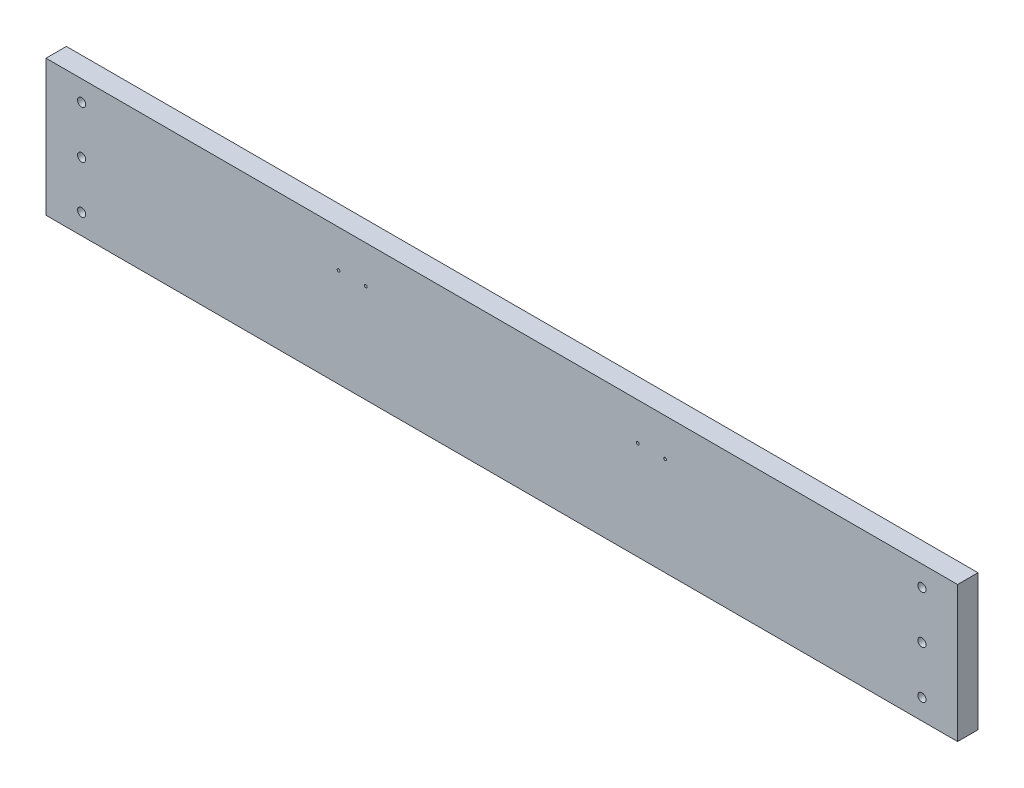
ISO-10303-21;
HEADER;
FILE_DESCRIPTION(('STEP AP214'),'2;1');
FILE_NAME('part.step','',(''),(''),'','','');
FILE_SCHEMA(('AUTOMOTIVE_DESIGN { 1 0 10303 214 1 1 1 1 }'));
ENDSEC;
DATA;
#1=APPLICATION_CONTEXT('core data for automotive mechanical design processes');
#2=APPLICATION_PROTOCOL_DEFINITION('international standard','automotive_design',2000,#1);
#3=PRODUCT_CONTEXT('',#1,'mechanical');
#4=PRODUCT('Part','Part','',(#3));
#5=PRODUCT_RELATED_PRODUCT_CATEGORY('part','',(#4));
#6=PRODUCT_DEFINITION_FORMATION('','',#4);
#7=PRODUCT_DEFINITION_CONTEXT('part definition',#1,'design');
#8=PRODUCT_DEFINITION('design','',#6,#7);
#9=PRODUCT_DEFINITION_SHAPE('','',#8);
#10=(LENGTH_UNIT() NAMED_UNIT(*) SI_UNIT(.MILLI.,.METRE.));
#11=(NAMED_UNIT(*) PLANE_ANGLE_UNIT() SI_UNIT($,.RADIAN.));
#12=(NAMED_UNIT(*) SI_UNIT($,.STERADIAN.) SOLID_ANGLE_UNIT());
#13=UNCERTAINTY_MEASURE_WITH_UNIT(LENGTH_MEASURE(1.E-05),#10,'distance_accuracy_value','');
#14=(GEOMETRIC_REPRESENTATION_CONTEXT(3) GLOBAL_UNCERTAINTY_ASSIGNED_CONTEXT((#13)) GLOBAL_UNIT_ASSIGNED_CONTEXT((#10,
#11,#12)) REPRESENTATION_CONTEXT('',''));
#15=CARTESIAN_POINT('',(0.,0.,0.));
#16=DIRECTION('',(0.,0.,1.));
#17=DIRECTION('',(1.,0.,0.));
#18=AXIS2_PLACEMENT_3D('',#15,#16,#17);
#19=CARTESIAN_POINT('',(0.,127.,0.));
#20=DIRECTION('',(0.,0.,-1.));
#21=DIRECTION('',(-1.,0.,0.));
#22=AXIS2_PLACEMENT_3D('',#19,#20,#21);
#23=PLANE('',#22);
#24=CARTESIAN_POINT('',(279.4,91.9479999999999,0.));
#25=DIRECTION('',(0.,0.,-1.));
#26=DIRECTION('',(-1.,0.,0.));
#27=AXIS2_PLACEMENT_3D('',#24,#25,#26);
#28=CIRCLE('',#27,1.27000000000004);
#29=CARTESIAN_POINT('',(278.13,91.9479999999999,0.));
#30=VERTEX_POINT('',#29);
#31=EDGE_CURVE('E377',#30,#30,#28,.F.);
#32=ORIENTED_EDGE('',*,*,#31,.T.);
#33=EDGE_LOOP('',(#32));
#34=FACE_BOUND('',#33,.T.);
#35=CARTESIAN_POINT('',(254.,91.9479999999999,0.));
#36=DIRECTION('',(0.,0.,-1.));
#37=DIRECTION('',(-1.,0.,0.));
#38=AXIS2_PLACEMENT_3D('',#35,#36,#37);
#39=CIRCLE('',#38,1.27000000000004);
#40=CARTESIAN_POINT('',(252.73,91.9479999999999,0.));
#41=VERTEX_POINT('',#40);
#42=EDGE_CURVE('E381',#41,#41,#39,.F.);
#43=ORIENTED_EDGE('',*,*,#42,.T.);
#44=EDGE_LOOP('',(#43));
#45=FACE_BOUND('',#44,.T.);
#46=CARTESIAN_POINT('',(14.224,63.5,0.));
#47=DIRECTION('',(0.,0.,-1.));
#48=DIRECTION('',(-1.,0.,0.));
#49=AXIS2_PLACEMENT_3D('',#46,#47,#48);
#50=CIRCLE('',#49,3.80999999999999);
#51=CARTESIAN_POINT('',(10.414,63.5,0.));
#52=VERTEX_POINT('',#51);
#53=EDGE_CURVE('E248',#52,#52,#50,.F.);
#54=ORIENTED_EDGE('',*,*,#53,.T.);
#55=EDGE_LOOP('',(#54));
#56=FACE_BOUND('',#55,.T.);
#57=CARTESIAN_POINT('',(14.224,19.05,0.));
#58=DIRECTION('',(0.,0.,-1.));
#59=DIRECTION('',(-1.,0.,0.));
#60=AXIS2_PLACEMENT_3D('',#57,#58,#59);
#61=CIRCLE('',#60,3.80999999999999);
#62=CARTESIAN_POINT('',(10.414,19.05,0.));
#63=VERTEX_POINT('',#62);
#64=EDGE_CURVE('E255',#63,#63,#61,.F.);
#65=ORIENTED_EDGE('',*,*,#64,.T.);
#66=EDGE_LOOP('',(#65));
#67=FACE_BOUND('',#66,.T.);
#68=CARTESIAN_POINT('',(14.224,107.95,0.));
#69=DIRECTION('',(0.,0.,-1.));
#70=DIRECTION('',(-1.,0.,0.));
#71=AXIS2_PLACEMENT_3D('',#68,#69,#70);
#72=CIRCLE('',#71,3.80999999999999);
#73=CARTESIAN_POINT('',(10.414,107.95,0.));
#74=VERTEX_POINT('',#73);
#75=EDGE_CURVE('E251',#74,#74,#72,.F.);
#76=ORIENTED_EDGE('',*,*,#75,.T.);
#77=EDGE_LOOP('',(#76));
#78=FACE_BOUND('',#77,.T.);
#79=CARTESIAN_POINT('',(798.576,63.5,0.));
#80=DIRECTION('',(0.,0.,-1.));
#81=DIRECTION('',(-1.,0.,0.));
#82=AXIS2_PLACEMENT_3D('',#79,#80,#81);
#83=CIRCLE('',#82,3.80999999999999);
#84=CARTESIAN_POINT('',(794.766,63.5,0.));
#85=VERTEX_POINT('',#84);
#86=EDGE_CURVE('E242',#85,#85,#83,.T.);
#87=ORIENTED_EDGE('',*,*,#86,.F.);
#88=EDGE_LOOP('',(#87));
#89=FACE_BOUND('',#88,.T.);
#90=CARTESIAN_POINT('',(798.576,107.95,0.));
#91=DIRECTION('',(0.,0.,-1.));
#92=DIRECTION('',(-1.,0.,0.));
#93=AXIS2_PLACEMENT_3D('',#90,#91,#92);
#94=CIRCLE('',#93,3.80999999999999);
#95=CARTESIAN_POINT('',(794.766,107.95,0.));
#96=VERTEX_POINT('',#95);
#97=EDGE_CURVE('E267',#96,#96,#94,.T.);
#98=ORIENTED_EDGE('',*,*,#97,.F.);
#99=EDGE_LOOP('',(#98));
#100=FACE_BOUND('',#99,.T.);
#101=CARTESIAN_POINT('',(798.576,19.05,0.));
#102=DIRECTION('',(0.,0.,-1.));
#103=DIRECTION('',(-1.,0.,0.));
#104=AXIS2_PLACEMENT_3D('',#101,#102,#103);
#105=CIRCLE('',#104,3.80999999999999);
#106=CARTESIAN_POINT('',(794.766,19.05,0.));
#107=VERTEX_POINT('',#106);
#108=EDGE_CURVE('E261',#107,#107,#105,.T.);
#109=ORIENTED_EDGE('',*,*,#108,.F.);
#110=EDGE_LOOP('',(#109));
#111=FACE_BOUND('',#110,.T.);
#112=CARTESIAN_POINT('',(682.498,28.702,0.));
#113=DIRECTION('',(0.,0.,-1.));
#114=DIRECTION('',(-1.,0.,0.));
#115=AXIS2_PLACEMENT_3D('',#112,#113,#114);
#116=CIRCLE('',#115,19.05);
#117=CARTESIAN_POINT('',(663.448,28.702,0.));
#118=VERTEX_POINT('',#117);
#119=CARTESIAN_POINT('',(701.548,28.702,0.));
#120=VERTEX_POINT('',#119);
#121=EDGE_CURVE('E180',#118,#120,#116,.T.);
#122=ORIENTED_EDGE('',*,*,#121,.F.);
#123=DIRECTION('',(0.,-1.,0.));
#124=VECTOR('',#123,1.);
#125=CARTESIAN_POINT('',(663.448,0.,0.));
#126=LINE('',#125,#124);
#127=CARTESIAN_POINT('',(663.448,0.,0.));
#128=VERTEX_POINT('',#127);
#129=EDGE_CURVE('E159',#118,#128,#126,.T.);
#130=ORIENTED_EDGE('',*,*,#129,.T.);
#131=DIRECTION('',(1.,0.,0.));
#132=VECTOR('',#131,1.);
#133=CARTESIAN_POINT('',(0.,0.,0.));
#134=LINE('',#133,#132);
#135=CARTESIAN_POINT('',(425.45,0.,0.));
#136=VERTEX_POINT('',#135);
#137=EDGE_CURVE('E349',#136,#128,#134,.T.);
#138=ORIENTED_EDGE('',*,*,#137,.F.);
#139=DIRECTION('',(0.,-1.,0.));
#140=VECTOR('',#139,1.);
#141=CARTESIAN_POINT('',(425.45,0.,0.));
#142=LINE('',#141,#140);
#143=CARTESIAN_POINT('',(425.45,28.702,0.));
#144=VERTEX_POINT('',#143);
#145=EDGE_CURVE('E203',#144,#136,#142,.T.);
#146=ORIENTED_EDGE('',*,*,#145,.F.);
#147=CARTESIAN_POINT('',(406.4,28.702,0.));
#148=DIRECTION('',(0.,0.,-1.));
#149=DIRECTION('',(-1.,0.,0.));
#150=AXIS2_PLACEMENT_3D('',#147,#148,#149);
#151=CIRCLE('',#150,19.05);
#152=CARTESIAN_POINT('',(387.35,28.702,0.));
#153=VERTEX_POINT('',#152);
#154=EDGE_CURVE('E200',#153,#144,#151,.T.);
#155=ORIENTED_EDGE('',*,*,#154,.F.);
#156=DIRECTION('',(0.,-1.,0.));
#157=VECTOR('',#156,1.);
#158=CARTESIAN_POINT('',(387.35,0.,0.));
#159=LINE('',#158,#157);
#160=CARTESIAN_POINT('',(387.35,0.,0.));
#161=VERTEX_POINT('',#160);
#162=EDGE_CURVE('E193',#153,#161,#159,.T.);
#163=ORIENTED_EDGE('',*,*,#162,.T.);
#164=CARTESIAN_POINT('',(149.352,0.,0.));
#165=VERTEX_POINT('',#164);
#166=EDGE_CURVE('E295',#165,#161,#134,.T.);
#167=ORIENTED_EDGE('',*,*,#166,.F.);
#168=DIRECTION('',(0.,-1.,0.));
#169=VECTOR('',#168,1.);
#170=CARTESIAN_POINT('',(149.352,0.,0.));
#171=LINE('',#170,#169);
#172=CARTESIAN_POINT('',(149.352,28.702,0.));
#173=VERTEX_POINT('',#172);
#174=EDGE_CURVE('E218',#173,#165,#171,.T.);
#175=ORIENTED_EDGE('',*,*,#174,.F.);
#176=CARTESIAN_POINT('',(130.302,28.702,0.));
#177=DIRECTION('',(0.,0.,-1.));
#178=DIRECTION('',(-1.,0.,0.));
#179=AXIS2_PLACEMENT_3D('',#176,#177,#178);
#180=CIRCLE('',#179,19.05);
#181=CARTESIAN_POINT('',(111.252,28.702,0.));
#182=VERTEX_POINT('',#181);
#183=EDGE_CURVE('E230',#182,#173,#180,.T.);
#184=ORIENTED_EDGE('',*,*,#183,.F.);
#185=DIRECTION('',(0.,-1.,0.));
#186=VECTOR('',#185,1.);
#187=CARTESIAN_POINT('',(111.252,0.,0.));
#188=LINE('',#187,#186);
#189=CARTESIAN_POINT('',(111.252,0.,0.));
#190=VERTEX_POINT('',#189);
#191=EDGE_CURVE('E227',#182,#190,#188,.T.);
#192=ORIENTED_EDGE('',*,*,#191,.T.);
#193=CARTESIAN_POINT('',(-19.05,0.,0.));
#194=VERTEX_POINT('',#193);
#195=EDGE_CURVE('E291',#194,#190,#134,.T.);
#196=ORIENTED_EDGE('',*,*,#195,.F.);
#197=DIRECTION('',(0.,-1.,0.));
#198=VECTOR('',#197,1.);
#199=CARTESIAN_POINT('',(-19.05,127.,0.));
#200=LINE('',#199,#198);
#201=CARTESIAN_POINT('',(-19.05,127.,0.));
#202=VERTEX_POINT('',#201);
#203=EDGE_CURVE('E11',#202,#194,#200,.T.);
#204=ORIENTED_EDGE('',*,*,#203,.F.);
#205=DIRECTION('',(1.,0.,0.));
#206=VECTOR('',#205,1.);
#207=CARTESIAN_POINT('',(0.,127.,0.));
#208=LINE('',#207,#206);
#209=CARTESIAN_POINT('',(831.85,127.,0.));
#210=VERTEX_POINT('',#209);
#211=EDGE_CURVE('E278',#202,#210,#208,.T.);
#212=ORIENTED_EDGE('',*,*,#211,.T.);
#213=DIRECTION('',(0.,-1.,0.));
#214=VECTOR('',#213,1.);
#215=CARTESIAN_POINT('',(831.85,127.,0.));
#216=LINE('',#215,#214);
#217=CARTESIAN_POINT('',(831.85,0.,0.));
#218=VERTEX_POINT('',#217);
#219=EDGE_CURVE('E290',#210,#218,#216,.T.);
#220=ORIENTED_EDGE('',*,*,#219,.T.);
#221=CARTESIAN_POINT('',(701.548,0.,0.));
#222=VERTEX_POINT('',#221);
#223=EDGE_CURVE('E275',#222,#218,#134,.T.);
#224=ORIENTED_EDGE('',*,*,#223,.F.);
#225=DIRECTION('',(0.,-1.,0.));
#226=VECTOR('',#225,1.);
#227=CARTESIAN_POINT('',(701.548,0.,0.));
#228=LINE('',#227,#226);
#229=EDGE_CURVE('E171',#120,#222,#228,.T.);
#230=ORIENTED_EDGE('',*,*,#229,.F.);
#231=EDGE_LOOP('',(#122,#130,#138,#146,#155,#163,#167,#175,#184,#192,#196,#204,#212,#220,#224,#230));
#232=FACE_BOUND('',#231,.T.);
#233=CARTESIAN_POINT('',(533.4,91.9479999999999,0.));
#234=DIRECTION('',(0.,0.,-1.));
#235=DIRECTION('',(-1.,0.,0.));
#236=AXIS2_PLACEMENT_3D('',#233,#234,#235);
#237=CIRCLE('',#236,1.27000000000003);
#238=CARTESIAN_POINT('',(532.13,91.9479999999999,0.));
#239=VERTEX_POINT('',#238);
#240=EDGE_CURVE('E641',#239,#239,#237,.T.);
#241=ORIENTED_EDGE('',*,*,#240,.F.);
#242=EDGE_LOOP('',(#241));
#243=FACE_BOUND('',#242,.T.);
#244=CARTESIAN_POINT('',(558.8,91.9479999999999,0.));
#245=DIRECTION('',(0.,0.,-1.));
#246=DIRECTION('',(-1.,0.,0.));
#247=AXIS2_PLACEMENT_3D('',#244,#245,#246);
#248=CIRCLE('',#247,1.27000000000003);
#249=CARTESIAN_POINT('',(557.53,91.9479999999999,0.));
#250=VERTEX_POINT('',#249);
#251=EDGE_CURVE('E635',#250,#250,#248,.T.);
#252=ORIENTED_EDGE('',*,*,#251,.F.);
#253=EDGE_LOOP('',(#252));
#254=FACE_BOUND('',#253,.T.);
#255=ADVANCED_FACE('F40',(#34,#45,#56,#67,#78,#89,#100,#111,#232,#243,#254),#23,.T.);
#256=CARTESIAN_POINT('',(0.,127.,19.0500000000001));
#257=DIRECTION('',(0.,0.,1.));
#258=DIRECTION('',(1.,0.,0.));
#259=AXIS2_PLACEMENT_3D('',#256,#257,#258);
#260=PLANE('',#259);
#261=CARTESIAN_POINT('',(279.4,91.9479999999999,19.05));
#262=DIRECTION('',(0.,0.,-1.));
#263=DIRECTION('',(-1.,0.,0.));
#264=AXIS2_PLACEMENT_3D('',#261,#262,#263);
#265=CIRCLE('',#264,1.27000000000004);
#266=CARTESIAN_POINT('',(278.13,91.9479999999999,19.05));
#267=VERTEX_POINT('',#266);
#268=EDGE_CURVE('E646',#267,#267,#265,.F.);
#269=ORIENTED_EDGE('',*,*,#268,.F.);
#270=EDGE_LOOP('',(#269));
#271=FACE_BOUND('',#270,.T.);
#272=CARTESIAN_POINT('',(254.,91.9479999999999,19.05));
#273=DIRECTION('',(0.,0.,-1.));
#274=DIRECTION('',(-1.,0.,0.));
#275=AXIS2_PLACEMENT_3D('',#272,#273,#274);
#276=CIRCLE('',#275,1.27000000000004);
#277=CARTESIAN_POINT('',(252.73,91.9479999999999,19.05));
#278=VERTEX_POINT('',#277);
#279=EDGE_CURVE('E650',#278,#278,#276,.F.);
#280=ORIENTED_EDGE('',*,*,#279,.F.);
#281=EDGE_LOOP('',(#280));
#282=FACE_BOUND('',#281,.T.);
#283=CARTESIAN_POINT('',(14.224,63.5,19.05));
#284=DIRECTION('',(0.,0.,-1.));
#285=DIRECTION('',(-1.,0.,0.));
#286=AXIS2_PLACEMENT_3D('',#283,#284,#285);
#287=CIRCLE('',#286,3.80999999999999);
#288=CARTESIAN_POINT('',(10.414,63.5,19.05));
#289=VERTEX_POINT('',#288);
#290=EDGE_CURVE('E252',#289,#289,#287,.F.);
#291=ORIENTED_EDGE('',*,*,#290,.F.);
#292=EDGE_LOOP('',(#291));
#293=FACE_BOUND('',#292,.T.);
#294=CARTESIAN_POINT('',(14.224,19.05,19.05));
#295=DIRECTION('',(0.,0.,-1.));
#296=DIRECTION('',(-1.,0.,0.));
#297=AXIS2_PLACEMENT_3D('',#294,#295,#296);
#298=CIRCLE('',#297,3.80999999999999);
#299=CARTESIAN_POINT('',(10.414,19.05,19.05));
#300=VERTEX_POINT('',#299);
#301=EDGE_CURVE('E258',#300,#300,#298,.F.);
#302=ORIENTED_EDGE('',*,*,#301,.F.);
#303=EDGE_LOOP('',(#302));
#304=FACE_BOUND('',#303,.T.);
#305=CARTESIAN_POINT('',(14.224,107.95,19.05));
#306=DIRECTION('',(0.,0.,-1.));
#307=DIRECTION('',(-1.,0.,0.));
#308=AXIS2_PLACEMENT_3D('',#305,#306,#307);
#309=CIRCLE('',#308,3.80999999999999);
#310=CARTESIAN_POINT('',(10.414,107.95,19.05));
#311=VERTEX_POINT('',#310);
#312=EDGE_CURVE('E272',#311,#311,#309,.F.);
#313=ORIENTED_EDGE('',*,*,#312,.F.);
#314=EDGE_LOOP('',(#313));
#315=FACE_BOUND('',#314,.T.);
#316=DIRECTION('',(-1.,0.,0.));
#317=VECTOR('',#316,1.);
#318=CARTESIAN_POINT('',(0.,0.,19.0500000000001));
#319=LINE('',#318,#317);
#320=CARTESIAN_POINT('',(831.85,0.,19.05));
#321=VERTEX_POINT('',#320);
#322=CARTESIAN_POINT('',(-19.05,0.,19.0500000000001));
#323=VERTEX_POINT('',#322);
#324=EDGE_CURVE('E298',#321,#323,#319,.T.);
#325=ORIENTED_EDGE('',*,*,#324,.F.);
#326=DIRECTION('',(0.,-1.,0.));
#327=VECTOR('',#326,1.);
#328=CARTESIAN_POINT('',(831.85,127.,19.05));
#329=LINE('',#328,#327);
#330=CARTESIAN_POINT('',(831.85,127.,19.05));
#331=VERTEX_POINT('',#330);
#332=EDGE_CURVE('E305',#331,#321,#329,.T.);
#333=ORIENTED_EDGE('',*,*,#332,.F.);
#334=DIRECTION('',(-1.,0.,0.));
#335=VECTOR('',#334,1.);
#336=CARTESIAN_POINT('',(0.,127.,19.0500000000001));
#337=LINE('',#336,#335);
#338=CARTESIAN_POINT('',(-19.05,127.,19.0500000000001));
#339=VERTEX_POINT('',#338);
#340=EDGE_CURVE('E284',#331,#339,#337,.T.);
#341=ORIENTED_EDGE('',*,*,#340,.T.);
#342=DIRECTION('',(0.,-1.,0.));
#343=VECTOR('',#342,1.);
#344=CARTESIAN_POINT('',(-19.05,127.,19.0500000000001));
#345=LINE('',#344,#343);
#346=EDGE_CURVE('E47',#339,#323,#345,.T.);
#347=ORIENTED_EDGE('',*,*,#346,.T.);
#348=EDGE_LOOP('',(#325,#333,#341,#347));
#349=FACE_BOUND('',#348,.T.);
#350=CARTESIAN_POINT('',(798.576,63.5,19.05));
#351=DIRECTION('',(0.,0.,-1.));
#352=DIRECTION('',(-1.,0.,0.));
#353=AXIS2_PLACEMENT_3D('',#350,#351,#352);
#354=CIRCLE('',#353,3.80999999999999);
#355=CARTESIAN_POINT('',(794.766,63.5,19.05));
#356=VERTEX_POINT('',#355);
#357=EDGE_CURVE('E186',#356,#356,#354,.T.);
#358=ORIENTED_EDGE('',*,*,#357,.T.);
#359=EDGE_LOOP('',(#358));
#360=FACE_BOUND('',#359,.T.);
#361=CARTESIAN_POINT('',(798.576,107.95,19.05));
#362=DIRECTION('',(0.,0.,-1.));
#363=DIRECTION('',(-1.,0.,0.));
#364=AXIS2_PLACEMENT_3D('',#361,#362,#363);
#365=CIRCLE('',#364,3.80999999999999);
#366=CARTESIAN_POINT('',(794.766,107.95,19.05));
#367=VERTEX_POINT('',#366);
#368=EDGE_CURVE('E245',#367,#367,#365,.T.);
#369=ORIENTED_EDGE('',*,*,#368,.T.);
#370=EDGE_LOOP('',(#369));
#371=FACE_BOUND('',#370,.T.);
#372=CARTESIAN_POINT('',(798.576,19.05,19.05));
#373=DIRECTION('',(0.,0.,-1.));
#374=DIRECTION('',(-1.,0.,0.));
#375=AXIS2_PLACEMENT_3D('',#372,#373,#374);
#376=CIRCLE('',#375,3.80999999999999);
#377=CARTESIAN_POINT('',(794.766,19.05,19.05));
#378=VERTEX_POINT('',#377);
#379=EDGE_CURVE('E264',#378,#378,#376,.T.);
#380=ORIENTED_EDGE('',*,*,#379,.T.);
#381=EDGE_LOOP('',(#380));
#382=FACE_BOUND('',#381,.T.);
#383=CARTESIAN_POINT('',(533.4,91.9479999999999,19.05));
#384=DIRECTION('',(0.,0.,-1.));
#385=DIRECTION('',(-1.,0.,0.));
#386=AXIS2_PLACEMENT_3D('',#383,#384,#385);
#387=CIRCLE('',#386,1.27000000000003);
#388=CARTESIAN_POINT('',(532.13,91.9479999999999,19.05));
#389=VERTEX_POINT('',#388);
#390=EDGE_CURVE('E637',#389,#389,#387,.T.);
#391=ORIENTED_EDGE('',*,*,#390,.T.);
#392=EDGE_LOOP('',(#391));
#393=FACE_BOUND('',#392,.T.);
#394=CARTESIAN_POINT('',(558.8,91.9479999999999,19.05));
#395=DIRECTION('',(0.,0.,-1.));
#396=DIRECTION('',(-1.,0.,0.));
#397=AXIS2_PLACEMENT_3D('',#394,#395,#396);
#398=CIRCLE('',#397,1.27000000000003);
#399=CARTESIAN_POINT('',(557.53,91.9479999999999,19.05));
#400=VERTEX_POINT('',#399);
#401=EDGE_CURVE('E231',#400,#400,#398,.T.);
#402=ORIENTED_EDGE('',*,*,#401,.T.);
#403=EDGE_LOOP('',(#402));
#404=FACE_BOUND('',#403,.T.);
#405=ADVANCED_FACE('F309',(#271,#282,#293,#304,#315,#349,#360,#371,#382,#393,#404),#260,.T.);
#406=CARTESIAN_POINT('',(0.,0.,0.));
#407=DIRECTION('',(0.,1.,0.));
#408=DIRECTION('',(0.,0.,1.));
#409=AXIS2_PLACEMENT_3D('',#406,#407,#408);
#410=PLANE('',#409);
#411=DIRECTION('',(0.,0.,-1.));
#412=VECTOR('',#411,1.);
#413=CARTESIAN_POINT('',(663.448,0.,5.08));
#414=LINE('',#413,#412);
#415=CARTESIAN_POINT('',(663.448,0.,5.08));
#416=VERTEX_POINT('',#415);
#417=EDGE_CURVE('E184',#416,#128,#414,.T.);
#418=ORIENTED_EDGE('',*,*,#417,.F.);
#419=DIRECTION('',(-1.,0.,0.));
#420=VECTOR('',#419,1.);
#421=CARTESIAN_POINT('',(0.,0.,5.08));
#422=LINE('',#421,#420);
#423=CARTESIAN_POINT('',(701.548,0.,5.08));
#424=VERTEX_POINT('',#423);
#425=EDGE_CURVE('E165',#424,#416,#422,.T.);
#426=ORIENTED_EDGE('',*,*,#425,.F.);
#427=DIRECTION('',(0.,0.,-1.));
#428=VECTOR('',#427,1.);
#429=CARTESIAN_POINT('',(701.548,0.,5.08));
#430=LINE('',#429,#428);
#431=EDGE_CURVE('E187',#424,#222,#430,.T.);
#432=ORIENTED_EDGE('',*,*,#431,.T.);
#433=ORIENTED_EDGE('',*,*,#223,.T.);
#434=DIRECTION('',(0.,0.,1.));
#435=VECTOR('',#434,1.);
#436=CARTESIAN_POINT('',(831.85,0.,0.));
#437=LINE('',#436,#435);
#438=EDGE_CURVE('E282',#218,#321,#437,.T.);
#439=ORIENTED_EDGE('',*,*,#438,.T.);
#440=ORIENTED_EDGE('',*,*,#324,.T.);
#441=DIRECTION('',(0.,0.,1.));
#442=VECTOR('',#441,1.);
#443=CARTESIAN_POINT('',(-19.05,0.,0.));
#444=LINE('',#443,#442);
#445=EDGE_CURVE('E294',#194,#323,#444,.T.);
#446=ORIENTED_EDGE('',*,*,#445,.F.);
#447=ORIENTED_EDGE('',*,*,#195,.T.);
#448=DIRECTION('',(0.,0.,-1.));
#449=VECTOR('',#448,1.);
#450=CARTESIAN_POINT('',(111.252,0.,5.08));
#451=LINE('',#450,#449);
#452=CARTESIAN_POINT('',(111.252,0.,5.08));
#453=VERTEX_POINT('',#452);
#454=EDGE_CURVE('E204',#453,#190,#451,.T.);
#455=ORIENTED_EDGE('',*,*,#454,.F.);
#456=DIRECTION('',(-1.,0.,0.));
#457=VECTOR('',#456,1.);
#458=CARTESIAN_POINT('',(0.,0.,5.08));
#459=LINE('',#458,#457);
#460=CARTESIAN_POINT('',(149.352,0.,5.08));
#461=VERTEX_POINT('',#460);
#462=EDGE_CURVE('E223',#461,#453,#459,.T.);
#463=ORIENTED_EDGE('',*,*,#462,.F.);
#464=DIRECTION('',(0.,0.,-1.));
#465=VECTOR('',#464,1.);
#466=CARTESIAN_POINT('',(149.352,0.,5.08));
#467=LINE('',#466,#465);
#468=EDGE_CURVE('E236',#461,#165,#467,.T.);
#469=ORIENTED_EDGE('',*,*,#468,.T.);
#470=ORIENTED_EDGE('',*,*,#166,.T.);
#471=DIRECTION('',(0.,0.,-1.));
#472=VECTOR('',#471,1.);
#473=CARTESIAN_POINT('',(387.35,0.,5.08));
#474=LINE('',#473,#472);
#475=CARTESIAN_POINT('',(387.35,0.,5.08));
#476=VERTEX_POINT('',#475);
#477=EDGE_CURVE('E209',#476,#161,#474,.T.);
#478=ORIENTED_EDGE('',*,*,#477,.F.);
#479=DIRECTION('',(-1.,0.,0.));
#480=VECTOR('',#479,1.);
#481=CARTESIAN_POINT('',(0.,0.,5.08));
#482=LINE('',#481,#480);
#483=CARTESIAN_POINT('',(425.45,0.,5.08));
#484=VERTEX_POINT('',#483);
#485=EDGE_CURVE('E195',#484,#476,#482,.T.);
#486=ORIENTED_EDGE('',*,*,#485,.F.);
#487=DIRECTION('',(0.,0.,-1.));
#488=VECTOR('',#487,1.);
#489=CARTESIAN_POINT('',(425.45,0.,5.08));
#490=LINE('',#489,#488);
#491=EDGE_CURVE('E211',#484,#136,#490,.T.);
#492=ORIENTED_EDGE('',*,*,#491,.T.);
#493=ORIENTED_EDGE('',*,*,#137,.T.);
#494=EDGE_LOOP('',(#418,#426,#432,#433,#439,#440,#446,#447,#455,#463,#469,#470,#478,#486,#492,#493));
#495=FACE_BOUND('',#494,.T.);
#496=ADVANCED_FACE('F318',(#495),#410,.F.);
#497=CARTESIAN_POINT('',(-19.05,127.,0.));
#498=DIRECTION('',(1.,0.,0.));
#499=DIRECTION('',(0.,0.,-1.));
#500=AXIS2_PLACEMENT_3D('',#497,#498,#499);
#501=PLANE('',#500);
#502=ORIENTED_EDGE('',*,*,#445,.T.);
#503=ORIENTED_EDGE('',*,*,#346,.F.);
#504=DIRECTION('',(0.,0.,1.));
#505=VECTOR('',#504,1.);
#506=CARTESIAN_POINT('',(-19.05,127.,0.));
#507=LINE('',#506,#505);
#508=EDGE_CURVE('E281',#202,#339,#507,.T.);
#509=ORIENTED_EDGE('',*,*,#508,.F.);
#510=ORIENTED_EDGE('',*,*,#203,.T.);
#511=EDGE_LOOP('',(#502,#503,#509,#510));
#512=FACE_BOUND('',#511,.T.);
#513=ADVANCED_FACE('F315',(#512),#501,.F.);
#514=CARTESIAN_POINT('',(831.85,127.,0.));
#515=DIRECTION('',(1.,0.,0.));
#516=DIRECTION('',(0.,0.,-1.));
#517=AXIS2_PLACEMENT_3D('',#514,#515,#516);
#518=PLANE('',#517);
#519=ORIENTED_EDGE('',*,*,#438,.F.);
#520=ORIENTED_EDGE('',*,*,#219,.F.);
#521=DIRECTION('',(0.,0.,1.));
#522=VECTOR('',#521,1.);
#523=CARTESIAN_POINT('',(831.85,127.,0.));
#524=LINE('',#523,#522);
#525=EDGE_CURVE('E287',#210,#331,#524,.T.);
#526=ORIENTED_EDGE('',*,*,#525,.T.);
#527=ORIENTED_EDGE('',*,*,#332,.T.);
#528=EDGE_LOOP('',(#519,#520,#526,#527));
#529=FACE_BOUND('',#528,.T.);
#530=ADVANCED_FACE('F322',(#529),#518,.T.);
#531=CARTESIAN_POINT('',(0.,127.,0.));
#532=DIRECTION('',(0.,1.,0.));
#533=DIRECTION('',(0.,0.,1.));
#534=AXIS2_PLACEMENT_3D('',#531,#532,#533);
#535=PLANE('',#534);
#536=ORIENTED_EDGE('',*,*,#211,.F.);
#537=ORIENTED_EDGE('',*,*,#508,.T.);
#538=ORIENTED_EDGE('',*,*,#340,.F.);
#539=ORIENTED_EDGE('',*,*,#525,.F.);
#540=EDGE_LOOP('',(#536,#537,#538,#539));
#541=FACE_BOUND('',#540,.T.);
#542=ADVANCED_FACE('F326',(#541),#535,.T.);
#543=CARTESIAN_POINT('',(14.224,107.95,19.05));
#544=DIRECTION('',(0.,0.,-1.));
#545=DIRECTION('',(-1.,0.,0.));
#546=AXIS2_PLACEMENT_3D('',#543,#544,#545);
#547=CYLINDRICAL_SURFACE('',#546,3.80999999999999);
#548=ORIENTED_EDGE('',*,*,#312,.T.);
#549=EDGE_LOOP('',(#548));
#550=FACE_BOUND('',#549,.T.);
#551=ORIENTED_EDGE('',*,*,#75,.F.);
#552=EDGE_LOOP('',(#551));
#553=FACE_BOUND('',#552,.T.);
#554=ADVANCED_FACE('F413',(#550,#553),#547,.F.);
#555=CARTESIAN_POINT('',(798.576,63.5,19.05));
#556=DIRECTION('',(0.,0.,-1.));
#557=DIRECTION('',(-1.,0.,0.));
#558=AXIS2_PLACEMENT_3D('',#555,#556,#557);
#559=CYLINDRICAL_SURFACE('',#558,3.80999999999999);
#560=ORIENTED_EDGE('',*,*,#357,.F.);
#561=EDGE_LOOP('',(#560));
#562=FACE_BOUND('',#561,.T.);
#563=ORIENTED_EDGE('',*,*,#86,.T.);
#564=EDGE_LOOP('',(#563));
#565=FACE_BOUND('',#564,.T.);
#566=ADVANCED_FACE('F407',(#562,#565),#559,.F.);
#567=CARTESIAN_POINT('',(798.576,107.95,19.05));
#568=DIRECTION('',(0.,0.,-1.));
#569=DIRECTION('',(-1.,0.,0.));
#570=AXIS2_PLACEMENT_3D('',#567,#568,#569);
#571=CYLINDRICAL_SURFACE('',#570,3.80999999999999);
#572=ORIENTED_EDGE('',*,*,#368,.F.);
#573=EDGE_LOOP('',(#572));
#574=FACE_BOUND('',#573,.T.);
#575=ORIENTED_EDGE('',*,*,#97,.T.);
#576=EDGE_LOOP('',(#575));
#577=FACE_BOUND('',#576,.T.);
#578=ADVANCED_FACE('F397',(#574,#577),#571,.F.);
#579=CARTESIAN_POINT('',(798.576,19.05,19.05));
#580=DIRECTION('',(0.,0.,-1.));
#581=DIRECTION('',(-1.,0.,0.));
#582=AXIS2_PLACEMENT_3D('',#579,#580,#581);
#583=CYLINDRICAL_SURFACE('',#582,3.80999999999999);
#584=ORIENTED_EDGE('',*,*,#379,.F.);
#585=EDGE_LOOP('',(#584));
#586=FACE_BOUND('',#585,.T.);
#587=ORIENTED_EDGE('',*,*,#108,.T.);
#588=EDGE_LOOP('',(#587));
#589=FACE_BOUND('',#588,.T.);
#590=ADVANCED_FACE('F394',(#586,#589),#583,.F.);
#591=CARTESIAN_POINT('',(14.224,19.05,19.05));
#592=DIRECTION('',(0.,0.,-1.));
#593=DIRECTION('',(-1.,0.,0.));
#594=AXIS2_PLACEMENT_3D('',#591,#592,#593);
#595=CYLINDRICAL_SURFACE('',#594,3.80999999999999);
#596=ORIENTED_EDGE('',*,*,#301,.T.);
#597=EDGE_LOOP('',(#596));
#598=FACE_BOUND('',#597,.T.);
#599=ORIENTED_EDGE('',*,*,#64,.F.);
#600=EDGE_LOOP('',(#599));
#601=FACE_BOUND('',#600,.T.);
#602=ADVANCED_FACE('F396',(#598,#601),#595,.F.);
#603=CARTESIAN_POINT('',(14.224,63.5,19.05));
#604=DIRECTION('',(0.,0.,-1.));
#605=DIRECTION('',(-1.,0.,0.));
#606=AXIS2_PLACEMENT_3D('',#603,#604,#605);
#607=CYLINDRICAL_SURFACE('',#606,3.80999999999999);
#608=ORIENTED_EDGE('',*,*,#290,.T.);
#609=EDGE_LOOP('',(#608));
#610=FACE_BOUND('',#609,.T.);
#611=ORIENTED_EDGE('',*,*,#53,.F.);
#612=EDGE_LOOP('',(#611));
#613=FACE_BOUND('',#612,.T.);
#614=ADVANCED_FACE('F404',(#610,#613),#607,.F.);
#615=CARTESIAN_POINT('',(111.252,0.,5.08));
#616=DIRECTION('',(1.,0.,0.));
#617=DIRECTION('',(0.,0.,-1.));
#618=AXIS2_PLACEMENT_3D('',#615,#616,#617);
#619=PLANE('',#618);
#620=ORIENTED_EDGE('',*,*,#191,.F.);
#621=DIRECTION('',(0.,0.,-1.));
#622=VECTOR('',#621,1.);
#623=CARTESIAN_POINT('',(111.252,28.702,5.08));
#624=LINE('',#623,#622);
#625=CARTESIAN_POINT('',(111.252,28.702,5.08));
#626=VERTEX_POINT('',#625);
#627=EDGE_CURVE('E226',#626,#182,#624,.T.);
#628=ORIENTED_EDGE('',*,*,#627,.F.);
#629=DIRECTION('',(0.,-1.,0.));
#630=VECTOR('',#629,1.);
#631=CARTESIAN_POINT('',(111.252,0.,5.08));
#632=LINE('',#631,#630);
#633=EDGE_CURVE('E215',#626,#453,#632,.T.);
#634=ORIENTED_EDGE('',*,*,#633,.T.);
#635=ORIENTED_EDGE('',*,*,#454,.T.);
#636=EDGE_LOOP('',(#620,#628,#634,#635));
#637=FACE_BOUND('',#636,.T.);
#638=ADVANCED_FACE('F334',(#637),#619,.T.);
#639=CARTESIAN_POINT('',(149.352,0.,5.08));
#640=DIRECTION('',(1.,0.,0.));
#641=DIRECTION('',(0.,0.,-1.));
#642=AXIS2_PLACEMENT_3D('',#639,#640,#641);
#643=PLANE('',#642);
#644=ORIENTED_EDGE('',*,*,#174,.T.);
#645=ORIENTED_EDGE('',*,*,#468,.F.);
#646=DIRECTION('',(0.,-1.,0.));
#647=VECTOR('',#646,1.);
#648=CARTESIAN_POINT('',(149.352,0.,5.08));
#649=LINE('',#648,#647);
#650=CARTESIAN_POINT('',(149.352,28.702,5.08));
#651=VERTEX_POINT('',#650);
#652=EDGE_CURVE('E221',#651,#461,#649,.T.);
#653=ORIENTED_EDGE('',*,*,#652,.F.);
#654=DIRECTION('',(0.,0.,-1.));
#655=VECTOR('',#654,1.);
#656=CARTESIAN_POINT('',(149.352,28.702,5.08));
#657=LINE('',#656,#655);
#658=EDGE_CURVE('E239',#651,#173,#657,.T.);
#659=ORIENTED_EDGE('',*,*,#658,.T.);
#660=EDGE_LOOP('',(#644,#645,#653,#659));
#661=FACE_BOUND('',#660,.T.);
#662=ADVANCED_FACE('F342',(#661),#643,.F.);
#663=CARTESIAN_POINT('',(130.302,28.702,5.08));
#664=DIRECTION('',(0.,0.,-1.));
#665=DIRECTION('',(-1.,0.,0.));
#666=AXIS2_PLACEMENT_3D('',#663,#664,#665);
#667=CYLINDRICAL_SURFACE('',#666,19.05);
#668=ORIENTED_EDGE('',*,*,#183,.T.);
#669=ORIENTED_EDGE('',*,*,#658,.F.);
#670=CARTESIAN_POINT('',(130.302,28.702,5.08));
#671=DIRECTION('',(0.,0.,-1.));
#672=DIRECTION('',(-1.,0.,0.));
#673=AXIS2_PLACEMENT_3D('',#670,#671,#672);
#674=CIRCLE('',#673,19.05);
#675=EDGE_CURVE('E217',#626,#651,#674,.T.);
#676=ORIENTED_EDGE('',*,*,#675,.F.);
#677=ORIENTED_EDGE('',*,*,#627,.T.);
#678=EDGE_LOOP('',(#668,#669,#676,#677));
#679=FACE_BOUND('',#678,.T.);
#680=ADVANCED_FACE('F491',(#679),#667,.F.);
#681=CARTESIAN_POINT('',(0.,0.,5.08));
#682=DIRECTION('',(0.,0.,-1.));
#683=DIRECTION('',(-1.,0.,0.));
#684=AXIS2_PLACEMENT_3D('',#681,#682,#683);
#685=PLANE('',#684);
#686=ORIENTED_EDGE('',*,*,#633,.F.);
#687=ORIENTED_EDGE('',*,*,#675,.T.);
#688=ORIENTED_EDGE('',*,*,#652,.T.);
#689=ORIENTED_EDGE('',*,*,#462,.T.);
#690=EDGE_LOOP('',(#686,#687,#688,#689));
#691=FACE_BOUND('',#690,.T.);
#692=ADVANCED_FACE('F338',(#691),#685,.T.);
#693=CARTESIAN_POINT('',(406.4,28.702,5.08));
#694=DIRECTION('',(0.,0.,-1.));
#695=DIRECTION('',(-1.,0.,0.));
#696=AXIS2_PLACEMENT_3D('',#693,#694,#695);
#697=CYLINDRICAL_SURFACE('',#696,19.05);
#698=ORIENTED_EDGE('',*,*,#154,.T.);
#699=DIRECTION('',(0.,0.,-1.));
#700=VECTOR('',#699,1.);
#701=CARTESIAN_POINT('',(425.45,28.702,5.08));
#702=LINE('',#701,#700);
#703=CARTESIAN_POINT('',(425.45,28.702,5.08));
#704=VERTEX_POINT('',#703);
#705=EDGE_CURVE('E199',#704,#144,#702,.T.);
#706=ORIENTED_EDGE('',*,*,#705,.F.);
#707=CARTESIAN_POINT('',(406.4,28.702,5.08));
#708=DIRECTION('',(0.,0.,-1.));
#709=DIRECTION('',(-1.,0.,0.));
#710=AXIS2_PLACEMENT_3D('',#707,#708,#709);
#711=CIRCLE('',#710,19.05);
#712=CARTESIAN_POINT('',(387.35,28.702,5.08));
#713=VERTEX_POINT('',#712);
#714=EDGE_CURVE('E191',#713,#704,#711,.T.);
#715=ORIENTED_EDGE('',*,*,#714,.F.);
#716=DIRECTION('',(0.,0.,-1.));
#717=VECTOR('',#716,1.);
#718=CARTESIAN_POINT('',(387.35,28.702,5.08));
#719=LINE('',#718,#717);
#720=EDGE_CURVE('E181',#713,#153,#719,.T.);
#721=ORIENTED_EDGE('',*,*,#720,.T.);
#722=EDGE_LOOP('',(#698,#706,#715,#721));
#723=FACE_BOUND('',#722,.T.);
#724=ADVANCED_FACE('F510',(#723),#697,.F.);
#725=CARTESIAN_POINT('',(387.35,0.,5.08));
#726=DIRECTION('',(1.,0.,0.));
#727=DIRECTION('',(0.,0.,-1.));
#728=AXIS2_PLACEMENT_3D('',#725,#726,#727);
#729=PLANE('',#728);
#730=ORIENTED_EDGE('',*,*,#162,.F.);
#731=ORIENTED_EDGE('',*,*,#720,.F.);
#732=DIRECTION('',(0.,-1.,0.));
#733=VECTOR('',#732,1.);
#734=CARTESIAN_POINT('',(387.35,0.,5.08));
#735=LINE('',#734,#733);
#736=EDGE_CURVE('E197',#713,#476,#735,.T.);
#737=ORIENTED_EDGE('',*,*,#736,.T.);
#738=ORIENTED_EDGE('',*,*,#477,.T.);
#739=EDGE_LOOP('',(#730,#731,#737,#738));
#740=FACE_BOUND('',#739,.T.);
#741=ADVANCED_FACE('F519',(#740),#729,.T.);
#742=CARTESIAN_POINT('',(425.45,0.,5.08));
#743=DIRECTION('',(1.,0.,0.));
#744=DIRECTION('',(0.,0.,-1.));
#745=AXIS2_PLACEMENT_3D('',#742,#743,#744);
#746=PLANE('',#745);
#747=ORIENTED_EDGE('',*,*,#145,.T.);
#748=ORIENTED_EDGE('',*,*,#491,.F.);
#749=DIRECTION('',(0.,-1.,0.));
#750=VECTOR('',#749,1.);
#751=CARTESIAN_POINT('',(425.45,0.,5.08));
#752=LINE('',#751,#750);
#753=EDGE_CURVE('E62',#704,#484,#752,.T.);
#754=ORIENTED_EDGE('',*,*,#753,.F.);
#755=ORIENTED_EDGE('',*,*,#705,.T.);
#756=EDGE_LOOP('',(#747,#748,#754,#755));
#757=FACE_BOUND('',#756,.T.);
#758=ADVANCED_FACE('F529',(#757),#746,.F.);
#759=CARTESIAN_POINT('',(0.,0.,5.08));
#760=DIRECTION('',(0.,0.,-1.));
#761=DIRECTION('',(-1.,0.,0.));
#762=AXIS2_PLACEMENT_3D('',#759,#760,#761);
#763=PLANE('',#762);
#764=ORIENTED_EDGE('',*,*,#714,.T.);
#765=ORIENTED_EDGE('',*,*,#753,.T.);
#766=ORIENTED_EDGE('',*,*,#485,.T.);
#767=ORIENTED_EDGE('',*,*,#736,.F.);
#768=EDGE_LOOP('',(#764,#765,#766,#767));
#769=FACE_BOUND('',#768,.T.);
#770=ADVANCED_FACE('F364',(#769),#763,.T.);
#771=CARTESIAN_POINT('',(663.448,0.,5.08));
#772=DIRECTION('',(1.,0.,0.));
#773=DIRECTION('',(0.,0.,-1.));
#774=AXIS2_PLACEMENT_3D('',#771,#772,#773);
#775=PLANE('',#774);
#776=ORIENTED_EDGE('',*,*,#129,.F.);
#777=DIRECTION('',(0.,0.,-1.));
#778=VECTOR('',#777,1.);
#779=CARTESIAN_POINT('',(663.448,28.702,5.08));
#780=LINE('',#779,#778);
#781=CARTESIAN_POINT('',(663.448,28.702,5.08));
#782=VERTEX_POINT('',#781);
#783=EDGE_CURVE('E154',#782,#118,#780,.T.);
#784=ORIENTED_EDGE('',*,*,#783,.F.);
#785=DIRECTION('',(0.,-1.,0.));
#786=VECTOR('',#785,1.);
#787=CARTESIAN_POINT('',(663.448,0.,5.08));
#788=LINE('',#787,#786);
#789=EDGE_CURVE('E157',#782,#416,#788,.T.);
#790=ORIENTED_EDGE('',*,*,#789,.T.);
#791=ORIENTED_EDGE('',*,*,#417,.T.);
#792=EDGE_LOOP('',(#776,#784,#790,#791));
#793=FACE_BOUND('',#792,.T.);
#794=ADVANCED_FACE('F156',(#793),#775,.T.);
#795=CARTESIAN_POINT('',(701.548,0.,5.08));
#796=DIRECTION('',(1.,0.,0.));
#797=DIRECTION('',(0.,0.,-1.));
#798=AXIS2_PLACEMENT_3D('',#795,#796,#797);
#799=PLANE('',#798);
#800=ORIENTED_EDGE('',*,*,#229,.T.);
#801=ORIENTED_EDGE('',*,*,#431,.F.);
#802=DIRECTION('',(0.,-1.,0.));
#803=VECTOR('',#802,1.);
#804=CARTESIAN_POINT('',(701.548,0.,5.08));
#805=LINE('',#804,#803);
#806=CARTESIAN_POINT('',(701.548,28.702,5.08));
#807=VERTEX_POINT('',#806);
#808=EDGE_CURVE('E54',#807,#424,#805,.T.);
#809=ORIENTED_EDGE('',*,*,#808,.F.);
#810=DIRECTION('',(0.,0.,-1.));
#811=VECTOR('',#810,1.);
#812=CARTESIAN_POINT('',(701.548,28.702,5.08));
#813=LINE('',#812,#811);
#814=EDGE_CURVE('E164',#807,#120,#813,.T.);
#815=ORIENTED_EDGE('',*,*,#814,.T.);
#816=EDGE_LOOP('',(#800,#801,#809,#815));
#817=FACE_BOUND('',#816,.T.);
#818=ADVANCED_FACE('F356',(#817),#799,.F.);
#819=CARTESIAN_POINT('',(682.498,28.702,5.08));
#820=DIRECTION('',(0.,0.,-1.));
#821=DIRECTION('',(-1.,0.,0.));
#822=AXIS2_PLACEMENT_3D('',#819,#820,#821);
#823=CYLINDRICAL_SURFACE('',#822,19.05);
#824=ORIENTED_EDGE('',*,*,#121,.T.);
#825=ORIENTED_EDGE('',*,*,#814,.F.);
#826=CARTESIAN_POINT('',(682.498,28.702,5.08));
#827=DIRECTION('',(0.,0.,-1.));
#828=DIRECTION('',(-1.,0.,0.));
#829=AXIS2_PLACEMENT_3D('',#826,#827,#828);
#830=CIRCLE('',#829,19.05);
#831=EDGE_CURVE('E168',#782,#807,#830,.T.);
#832=ORIENTED_EDGE('',*,*,#831,.F.);
#833=ORIENTED_EDGE('',*,*,#783,.T.);
#834=EDGE_LOOP('',(#824,#825,#832,#833));
#835=FACE_BOUND('',#834,.T.);
#836=ADVANCED_FACE('F173',(#835),#823,.F.);
#837=CARTESIAN_POINT('',(0.,0.,5.08));
#838=DIRECTION('',(0.,0.,-1.));
#839=DIRECTION('',(-1.,0.,0.));
#840=AXIS2_PLACEMENT_3D('',#837,#838,#839);
#841=PLANE('',#840);
#842=ORIENTED_EDGE('',*,*,#789,.F.);
#843=ORIENTED_EDGE('',*,*,#831,.T.);
#844=ORIENTED_EDGE('',*,*,#808,.T.);
#845=ORIENTED_EDGE('',*,*,#425,.T.);
#846=EDGE_LOOP('',(#842,#843,#844,#845));
#847=FACE_BOUND('',#846,.T.);
#848=ADVANCED_FACE('F167',(#847),#841,.T.);
#849=CARTESIAN_POINT('',(254.,91.9479999999999,19.05));
#850=DIRECTION('',(0.,0.,-1.));
#851=DIRECTION('',(-1.,0.,0.));
#852=AXIS2_PLACEMENT_3D('',#849,#850,#851);
#853=CYLINDRICAL_SURFACE('',#852,1.27000000000004);
#854=ORIENTED_EDGE('',*,*,#279,.T.);
#855=EDGE_LOOP('',(#854));
#856=FACE_BOUND('',#855,.T.);
#857=ORIENTED_EDGE('',*,*,#42,.F.);
#858=EDGE_LOOP('',(#857));
#859=FACE_BOUND('',#858,.T.);
#860=ADVANCED_FACE('F573',(#856,#859),#853,.F.);
#861=CARTESIAN_POINT('',(279.4,91.9479999999999,19.05));
#862=DIRECTION('',(0.,0.,-1.));
#863=DIRECTION('',(-1.,0.,0.));
#864=AXIS2_PLACEMENT_3D('',#861,#862,#863);
#865=CYLINDRICAL_SURFACE('',#864,1.27000000000004);
#866=ORIENTED_EDGE('',*,*,#268,.T.);
#867=EDGE_LOOP('',(#866));
#868=FACE_BOUND('',#867,.T.);
#869=ORIENTED_EDGE('',*,*,#31,.F.);
#870=EDGE_LOOP('',(#869));
#871=FACE_BOUND('',#870,.T.);
#872=ADVANCED_FACE('F596',(#868,#871),#865,.F.);
#873=CARTESIAN_POINT('',(533.4,91.9479999999999,19.05));
#874=DIRECTION('',(0.,0.,-1.));
#875=DIRECTION('',(-1.,0.,0.));
#876=AXIS2_PLACEMENT_3D('',#873,#874,#875);
#877=CYLINDRICAL_SURFACE('',#876,1.27000000000003);
#878=ORIENTED_EDGE('',*,*,#390,.F.);
#879=EDGE_LOOP('',(#878));
#880=FACE_BOUND('',#879,.T.);
#881=ORIENTED_EDGE('',*,*,#240,.T.);
#882=EDGE_LOOP('',(#881));
#883=FACE_BOUND('',#882,.T.);
#884=ADVANCED_FACE('F606',(#880,#883),#877,.F.);
#885=CARTESIAN_POINT('',(558.8,91.9479999999999,19.05));
#886=DIRECTION('',(0.,0.,-1.));
#887=DIRECTION('',(-1.,0.,0.));
#888=AXIS2_PLACEMENT_3D('',#885,#886,#887);
#889=CYLINDRICAL_SURFACE('',#888,1.27000000000003);
#890=ORIENTED_EDGE('',*,*,#401,.F.);
#891=EDGE_LOOP('',(#890));
#892=FACE_BOUND('',#891,.T.);
#893=ORIENTED_EDGE('',*,*,#251,.T.);
#894=EDGE_LOOP('',(#893));
#895=FACE_BOUND('',#894,.T.);
#896=ADVANCED_FACE('F616',(#892,#895),#889,.F.);
#897=CLOSED_SHELL('',(#255,#405,#496,#513,#530,#542,#554,#566,#578,#590,#602,#614,#638,#662,
#680,#692,#724,#741,#758,#770,#794,#818,#836,#848,#860,#872,#884,#896));
#898=MANIFOLD_SOLID_BREP('B2',#897);
#899=ADVANCED_BREP_SHAPE_REPRESENTATION('',(#18,#898),#14);
#900=SHAPE_DEFINITION_REPRESENTATION(#9,#899);
ENDSEC;
END-ISO-10303-21;
